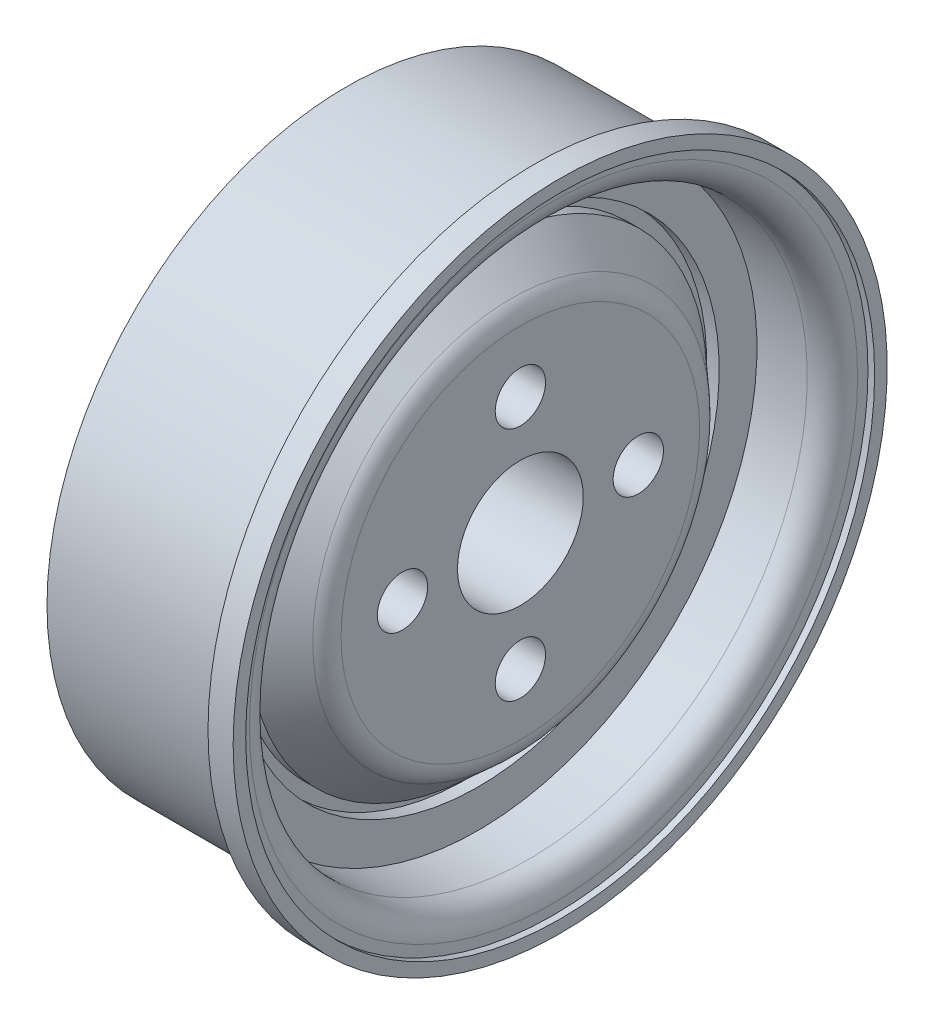
ISO-10303-21;
HEADER;
FILE_DESCRIPTION(('STEP AP214'),'2;1');
FILE_NAME('part.step','',(''),(''),'','','');
FILE_SCHEMA(('AUTOMOTIVE_DESIGN { 1 0 10303 214 1 1 1 1 }'));
ENDSEC;
DATA;
#1=APPLICATION_CONTEXT('core data for automotive mechanical design processes');
#2=APPLICATION_PROTOCOL_DEFINITION('international standard','automotive_design',2000,#1);
#3=PRODUCT_CONTEXT('',#1,'mechanical');
#4=PRODUCT('Part','Part','',(#3));
#5=PRODUCT_RELATED_PRODUCT_CATEGORY('part','',(#4));
#6=PRODUCT_DEFINITION_FORMATION('','',#4);
#7=PRODUCT_DEFINITION_CONTEXT('part definition',#1,'design');
#8=PRODUCT_DEFINITION('design','',#6,#7);
#9=PRODUCT_DEFINITION_SHAPE('','',#8);
#10=(LENGTH_UNIT() NAMED_UNIT(*) SI_UNIT(.MILLI.,.METRE.));
#11=(NAMED_UNIT(*) PLANE_ANGLE_UNIT() SI_UNIT($,.RADIAN.));
#12=(NAMED_UNIT(*) SI_UNIT($,.STERADIAN.) SOLID_ANGLE_UNIT());
#13=UNCERTAINTY_MEASURE_WITH_UNIT(LENGTH_MEASURE(1.E-05),#10,'distance_accuracy_value','');
#14=(GEOMETRIC_REPRESENTATION_CONTEXT(3) GLOBAL_UNCERTAINTY_ASSIGNED_CONTEXT((#13)) GLOBAL_UNIT_ASSIGNED_CONTEXT((#10,
#11,#12)) REPRESENTATION_CONTEXT('',''));
#15=CARTESIAN_POINT('',(0.,0.,0.));
#16=DIRECTION('',(0.,0.,1.));
#17=DIRECTION('',(1.,0.,0.));
#18=AXIS2_PLACEMENT_3D('',#15,#16,#17);
#19=CARTESIAN_POINT('',(-7.13969680177065,0.,0.));
#20=DIRECTION('',(-1.,0.,0.));
#21=DIRECTION('',(0.,0.,1.));
#22=AXIS2_PLACEMENT_3D('',#19,#20,#21);
#23=CYLINDRICAL_SURFACE('',#22,1.25);
#24=CARTESIAN_POINT('',(-4.83542244056852,0.,0.));
#25=DIRECTION('',(-1.,0.,0.));
#26=DIRECTION('',(0.,0.,1.));
#27=AXIS2_PLACEMENT_3D('',#24,#25,#26);
#28=CIRCLE('',#27,1.25);
#29=CARTESIAN_POINT('',(-4.83542244056852,0.,1.25));
#30=VERTEX_POINT('',#29);
#31=EDGE_CURVE('E125',#30,#30,#28,.T.);
#32=ORIENTED_EDGE('',*,*,#31,.T.);
#33=EDGE_LOOP('',(#32));
#34=FACE_BOUND('',#33,.T.);
#35=CARTESIAN_POINT('',(-1.15291247496068,0.,0.));
#36=DIRECTION('',(1.,0.,0.));
#37=DIRECTION('',(0.,0.,-1.));
#38=AXIS2_PLACEMENT_3D('',#35,#36,#37);
#39=CIRCLE('',#38,1.25);
#40=CARTESIAN_POINT('',(-1.15291247496068,0.,-1.25));
#41=VERTEX_POINT('',#40);
#42=EDGE_CURVE('E78',#41,#41,#39,.F.);
#43=ORIENTED_EDGE('',*,*,#42,.F.);
#44=EDGE_LOOP('',(#43));
#45=FACE_BOUND('',#44,.T.);
#46=ADVANCED_FACE('F39',(#34,#45),#23,.F.);
#47=CARTESIAN_POINT('',(5.42939435944994,0.,-12.5));
#48=DIRECTION('',(-1.,0.,0.));
#49=DIRECTION('',(0.,0.,1.));
#50=AXIS2_PLACEMENT_3D('',#47,#48,#49);
#51=PLANE('',#50);
#52=CARTESIAN_POINT('',(5.42939435944994,0.,0.));
#53=DIRECTION('',(-1.,0.,0.));
#54=DIRECTION('',(0.,0.,1.));
#55=AXIS2_PLACEMENT_3D('',#52,#53,#54);
#56=CIRCLE('',#55,13.);
#57=CARTESIAN_POINT('',(5.42939435944994,0.,13.));
#58=VERTEX_POINT('',#57);
#59=EDGE_CURVE('E86',#58,#58,#56,.T.);
#60=ORIENTED_EDGE('',*,*,#59,.F.);
#61=EDGE_LOOP('',(#60));
#62=FACE_BOUND('',#61,.T.);
#63=CARTESIAN_POINT('',(5.42939435944994,0.,0.));
#64=DIRECTION('',(-1.,0.,0.));
#65=DIRECTION('',(0.,0.,1.));
#66=AXIS2_PLACEMENT_3D('',#63,#64,#65);
#67=CIRCLE('',#66,12.5);
#68=CARTESIAN_POINT('',(5.42939435944994,0.,12.5));
#69=VERTEX_POINT('',#68);
#70=EDGE_CURVE('E54',#69,#69,#67,.T.);
#71=ORIENTED_EDGE('',*,*,#70,.T.);
#72=EDGE_LOOP('',(#71));
#73=FACE_BOUND('',#72,.T.);
#74=ADVANCED_FACE('F164',(#62,#73),#51,.F.);
#75=CARTESIAN_POINT('',(-7.13969680177065,0.,0.));
#76=DIRECTION('',(-1.,0.,0.));
#77=DIRECTION('',(0.,0.,1.));
#78=AXIS2_PLACEMENT_3D('',#75,#76,#77);
#79=CYLINDRICAL_SURFACE('',#78,12.5);
#80=ORIENTED_EDGE('',*,*,#70,.F.);
#81=EDGE_LOOP('',(#80));
#82=FACE_BOUND('',#81,.T.);
#83=CARTESIAN_POINT('',(5.16457755943148,0.,0.));
#84=DIRECTION('',(-1.,0.,0.));
#85=DIRECTION('',(0.,0.,1.));
#86=AXIS2_PLACEMENT_3D('',#83,#84,#85);
#87=CIRCLE('',#86,12.5);
#88=CARTESIAN_POINT('',(5.16457755943148,0.,12.5));
#89=VERTEX_POINT('',#88);
#90=EDGE_CURVE('E157',#89,#89,#87,.T.);
#91=ORIENTED_EDGE('',*,*,#90,.T.);
#92=EDGE_LOOP('',(#91));
#93=FACE_BOUND('',#92,.T.);
#94=ADVANCED_FACE('F166',(#82,#93),#79,.F.);
#95=CARTESIAN_POINT('',(5.16457755943148,0.,-12.5));
#96=DIRECTION('',(-1.,0.,0.));
#97=DIRECTION('',(0.,0.,1.));
#98=AXIS2_PLACEMENT_3D('',#95,#96,#97);
#99=PLANE('',#98);
#100=CARTESIAN_POINT('',(5.16457755943148,0.,0.));
#101=DIRECTION('',(-1.,0.,0.));
#102=DIRECTION('',(0.,0.,1.));
#103=AXIS2_PLACEMENT_3D('',#100,#101,#102);
#104=CIRCLE('',#103,12.0868416737905);
#105=CARTESIAN_POINT('',(5.16457755943148,0.,12.0868416737905));
#106=VERTEX_POINT('',#105);
#107=EDGE_CURVE('E48',#106,#106,#104,.T.);
#108=ORIENTED_EDGE('',*,*,#107,.T.);
#109=EDGE_LOOP('',(#108));
#110=FACE_BOUND('',#109,.T.);
#111=ORIENTED_EDGE('',*,*,#90,.F.);
#112=EDGE_LOOP('',(#111));
#113=FACE_BOUND('',#112,.T.);
#114=ADVANCED_FACE('F169',(#110,#113),#99,.F.);
#115=CARTESIAN_POINT('',(-7.13969680177065,0.,0.));
#116=DIRECTION('',(-1.,0.,0.));
#117=DIRECTION('',(0.,0.,1.));
#118=AXIS2_PLACEMENT_3D('',#115,#116,#117);
#119=CYLINDRICAL_SURFACE('',#118,11.0868416737905);
#120=CARTESIAN_POINT('',(4.16457755943148,0.,0.));
#121=DIRECTION('',(-1.,0.,0.));
#122=DIRECTION('',(0.,0.,1.));
#123=AXIS2_PLACEMENT_3D('',#120,#121,#122);
#124=CIRCLE('',#123,11.0868416737905);
#125=CARTESIAN_POINT('',(4.16457755943148,0.,11.0868416737905));
#126=VERTEX_POINT('',#125);
#127=EDGE_CURVE('E10',#126,#126,#124,.F.);
#128=ORIENTED_EDGE('',*,*,#127,.T.);
#129=EDGE_LOOP('',(#128));
#130=FACE_BOUND('',#129,.T.);
#131=CARTESIAN_POINT('',(2.16457755943148,0.,0.));
#132=DIRECTION('',(-1.,0.,0.));
#133=DIRECTION('',(0.,0.,1.));
#134=AXIS2_PLACEMENT_3D('',#131,#132,#133);
#135=CIRCLE('',#134,11.0868416737905);
#136=CARTESIAN_POINT('',(2.16457755943148,0.,11.0868416737905));
#137=VERTEX_POINT('',#136);
#138=EDGE_CURVE('E153',#137,#137,#135,.T.);
#139=ORIENTED_EDGE('',*,*,#138,.T.);
#140=EDGE_LOOP('',(#139));
#141=FACE_BOUND('',#140,.T.);
#142=ADVANCED_FACE('F174',(#130,#141),#119,.F.);
#143=CARTESIAN_POINT('',(2.16457755943148,0.,-11.0868416737905));
#144=DIRECTION('',(-1.,0.,0.));
#145=DIRECTION('',(0.,0.,1.));
#146=AXIS2_PLACEMENT_3D('',#143,#144,#145);
#147=PLANE('',#146);
#148=ORIENTED_EDGE('',*,*,#138,.F.);
#149=EDGE_LOOP('',(#148));
#150=FACE_BOUND('',#149,.T.);
#151=CARTESIAN_POINT('',(2.16457755943148,0.,0.));
#152=DIRECTION('',(-1.,0.,0.));
#153=DIRECTION('',(0.,0.,1.));
#154=AXIS2_PLACEMENT_3D('',#151,#152,#153);
#155=CIRCLE('',#154,9.58684167379053);
#156=CARTESIAN_POINT('',(2.16457755943148,0.,9.58684167379053));
#157=VERTEX_POINT('',#156);
#158=EDGE_CURVE('E149',#157,#157,#155,.T.);
#159=ORIENTED_EDGE('',*,*,#158,.T.);
#160=EDGE_LOOP('',(#159));
#161=FACE_BOUND('',#160,.T.);
#162=ADVANCED_FACE('F180',(#150,#161),#147,.F.);
#163=CARTESIAN_POINT('',(-7.13969680177065,0.,0.));
#164=DIRECTION('',(-1.,0.,0.));
#165=DIRECTION('',(0.,0.,1.));
#166=AXIS2_PLACEMENT_3D('',#163,#164,#165);
#167=CYLINDRICAL_SURFACE('',#166,9.58684167379053);
#168=ORIENTED_EDGE('',*,*,#158,.F.);
#169=EDGE_LOOP('',(#168));
#170=FACE_BOUND('',#169,.T.);
#171=CARTESIAN_POINT('',(1.66457755943148,0.,0.));
#172=DIRECTION('',(-1.,0.,0.));
#173=DIRECTION('',(0.,0.,1.));
#174=AXIS2_PLACEMENT_3D('',#171,#172,#173);
#175=CIRCLE('',#174,9.58684167379053);
#176=CARTESIAN_POINT('',(1.66457755943148,0.,9.58684167379053));
#177=VERTEX_POINT('',#176);
#178=EDGE_CURVE('E145',#177,#177,#175,.T.);
#179=ORIENTED_EDGE('',*,*,#178,.T.);
#180=EDGE_LOOP('',(#179));
#181=FACE_BOUND('',#180,.T.);
#182=ADVANCED_FACE('F212',(#170,#181),#167,.F.);
#183=CARTESIAN_POINT('',(1.66457755943148,0.,-9.58684167379053));
#184=DIRECTION('',(-1.,0.,0.));
#185=DIRECTION('',(0.,0.,1.));
#186=AXIS2_PLACEMENT_3D('',#183,#184,#185);
#187=PLANE('',#186);
#188=ORIENTED_EDGE('',*,*,#178,.F.);
#189=EDGE_LOOP('',(#188));
#190=FACE_BOUND('',#189,.T.);
#191=CARTESIAN_POINT('',(1.66457755943148,0.,0.));
#192=DIRECTION('',(-1.,0.,0.));
#193=DIRECTION('',(0.,0.,1.));
#194=AXIS2_PLACEMENT_3D('',#191,#192,#193);
#195=CIRCLE('',#194,9.08684167379053);
#196=CARTESIAN_POINT('',(1.66457755943148,0.,9.08684167379053));
#197=VERTEX_POINT('',#196);
#198=EDGE_CURVE('E141',#197,#197,#195,.T.);
#199=ORIENTED_EDGE('',*,*,#198,.T.);
#200=EDGE_LOOP('',(#199));
#201=FACE_BOUND('',#200,.T.);
#202=ADVANCED_FACE('F208',(#190,#201),#187,.F.);
#203=CARTESIAN_POINT('',(-7.13969680177065,0.,0.));
#204=DIRECTION('',(-1.,0.,0.));
#205=DIRECTION('',(0.,0.,1.));
#206=AXIS2_PLACEMENT_3D('',#203,#204,#205);
#207=CYLINDRICAL_SURFACE('',#206,9.08684167379053);
#208=ORIENTED_EDGE('',*,*,#198,.F.);
#209=EDGE_LOOP('',(#208));
#210=FACE_BOUND('',#209,.T.);
#211=CARTESIAN_POINT('',(2.16457755943148,0.,0.));
#212=DIRECTION('',(-1.,0.,0.));
#213=DIRECTION('',(0.,0.,1.));
#214=AXIS2_PLACEMENT_3D('',#211,#212,#213);
#215=CIRCLE('',#214,9.08684167379053);
#216=CARTESIAN_POINT('',(2.16457755943148,0.,9.08684167379053));
#217=VERTEX_POINT('',#216);
#218=EDGE_CURVE('E137',#217,#217,#215,.T.);
#219=ORIENTED_EDGE('',*,*,#218,.T.);
#220=EDGE_LOOP('',(#219));
#221=FACE_BOUND('',#220,.T.);
#222=ADVANCED_FACE('F204',(#210,#221),#207,.T.);
#223=CARTESIAN_POINT('',(3.48987513472586,0.,0.));
#224=DIRECTION('',(-1.,0.,0.));
#225=DIRECTION('',(0.,0.,1.));
#226=AXIS2_PLACEMENT_3D('',#223,#224,#225);
#227=CONICAL_SURFACE('',#226,7.89433478274952,0.73270631676556);
#228=ORIENTED_EDGE('',*,*,#218,.F.);
#229=EDGE_LOOP('',(#228));
#230=FACE_BOUND('',#229,.T.);
#231=CARTESIAN_POINT('',(3.48987513472586,0.,0.));
#232=DIRECTION('',(-1.,0.,0.));
#233=DIRECTION('',(0.,0.,1.));
#234=AXIS2_PLACEMENT_3D('',#231,#232,#233);
#235=CIRCLE('',#234,7.89433478274952);
#236=CARTESIAN_POINT('',(3.48987513472586,0.,7.89433478274952));
#237=VERTEX_POINT('',#236);
#238=EDGE_CURVE('E133',#237,#237,#235,.T.);
#239=ORIENTED_EDGE('',*,*,#238,.T.);
#240=EDGE_LOOP('',(#239));
#241=FACE_BOUND('',#240,.T.);
#242=ADVANCED_FACE('F200',(#230,#241),#227,.T.);
#243=CARTESIAN_POINT('',(2.84708752503932,0.,0.));
#244=DIRECTION('',(-1.,0.,0.));
#245=DIRECTION('',(0.,0.,1.));
#246=AXIS2_PLACEMENT_3D('',#243,#244,#245);
#247=TOROIDAL_SURFACE('',#246,7.12829033963054,1.);
#248=ORIENTED_EDGE('',*,*,#238,.F.);
#249=EDGE_LOOP('',(#248));
#250=FACE_BOUND('',#249,.T.);
#251=CARTESIAN_POINT('',(3.84708752503932,0.,0.));
#252=DIRECTION('',(-1.,0.,0.));
#253=DIRECTION('',(0.,0.,1.));
#254=AXIS2_PLACEMENT_3D('',#251,#252,#253);
#255=CIRCLE('',#254,7.12829033963054);
#256=CARTESIAN_POINT('',(3.84708752503932,0.,7.12829033963054));
#257=VERTEX_POINT('',#256);
#258=EDGE_CURVE('E129',#257,#257,#255,.T.);
#259=ORIENTED_EDGE('',*,*,#258,.T.);
#260=EDGE_LOOP('',(#259));
#261=FACE_BOUND('',#260,.T.);
#262=ADVANCED_FACE('F197',(#250,#261),#247,.T.);
#263=CARTESIAN_POINT('',(3.84708752503932,0.,-7.12829033963054));
#264=DIRECTION('',(-1.,0.,0.));
#265=DIRECTION('',(0.,0.,1.));
#266=AXIS2_PLACEMENT_3D('',#263,#264,#265);
#267=PLANE('',#266);
#268=CARTESIAN_POINT('',(3.84708752503932,4.68715005992047,0.));
#269=DIRECTION('',(-1.,0.,0.));
#270=DIRECTION('',(0.,0.,1.));
#271=AXIS2_PLACEMENT_3D('',#268,#269,#270);
#272=CIRCLE('',#271,1.);
#273=CARTESIAN_POINT('',(3.84708752503932,4.68715005992047,1.));
#274=VERTEX_POINT('',#273);
#275=EDGE_CURVE('E77',#274,#274,#272,.T.);
#276=ORIENTED_EDGE('',*,*,#275,.T.);
#277=EDGE_LOOP('',(#276));
#278=FACE_BOUND('',#277,.T.);
#279=CARTESIAN_POINT('',(3.84708752503932,1.32355801562059E-13,-4.6871500599206));
#280=DIRECTION('',(-1.,0.,0.));
#281=DIRECTION('',(0.,0.,1.));
#282=AXIS2_PLACEMENT_3D('',#279,#280,#281);
#283=CIRCLE('',#282,1.);
#284=CARTESIAN_POINT('',(3.84708752503932,1.32355801562059E-13,-3.6871500599206));
#285=VERTEX_POINT('',#284);
#286=EDGE_CURVE('E73',#285,#285,#283,.T.);
#287=ORIENTED_EDGE('',*,*,#286,.T.);
#288=EDGE_LOOP('',(#287));
#289=FACE_BOUND('',#288,.T.);
#290=CARTESIAN_POINT('',(3.84708752503932,-4.68715005992047,-2.64711603124119E-13));
#291=DIRECTION('',(-1.,0.,0.));
#292=DIRECTION('',(0.,0.,1.));
#293=AXIS2_PLACEMENT_3D('',#290,#291,#292);
#294=CIRCLE('',#293,1.);
#295=CARTESIAN_POINT('',(3.84708752503932,-4.68715005992047,0.999999999999735));
#296=VERTEX_POINT('',#295);
#297=EDGE_CURVE('E68',#296,#296,#294,.T.);
#298=ORIENTED_EDGE('',*,*,#297,.T.);
#299=EDGE_LOOP('',(#298));
#300=FACE_BOUND('',#299,.T.);
#301=CARTESIAN_POINT('',(3.84708752503932,-1.3292981189386E-13,4.68715005992033));
#302=DIRECTION('',(-1.,0.,0.));
#303=DIRECTION('',(0.,0.,1.));
#304=AXIS2_PLACEMENT_3D('',#301,#302,#303);
#305=CIRCLE('',#304,1.);
#306=CARTESIAN_POINT('',(3.84708752503932,-1.3292981189386E-13,5.68715005992033));
#307=VERTEX_POINT('',#306);
#308=EDGE_CURVE('E62',#307,#307,#305,.T.);
#309=ORIENTED_EDGE('',*,*,#308,.T.);
#310=EDGE_LOOP('',(#309));
#311=FACE_BOUND('',#310,.T.);
#312=CARTESIAN_POINT('',(3.84708752503932,0.,0.));
#313=DIRECTION('',(-1.,0.,0.));
#314=DIRECTION('',(0.,0.,1.));
#315=AXIS2_PLACEMENT_3D('',#312,#313,#314);
#316=CIRCLE('',#315,2.5);
#317=CARTESIAN_POINT('',(3.84708752503932,0.,2.5));
#318=VERTEX_POINT('',#317);
#319=EDGE_CURVE('E43',#318,#318,#316,.T.);
#320=ORIENTED_EDGE('',*,*,#319,.T.);
#321=EDGE_LOOP('',(#320));
#322=FACE_BOUND('',#321,.T.);
#323=ORIENTED_EDGE('',*,*,#258,.F.);
#324=EDGE_LOOP('',(#323));
#325=FACE_BOUND('',#324,.T.);
#326=ADVANCED_FACE('F194',(#278,#289,#300,#311,#322,#325),#267,.F.);
#327=CARTESIAN_POINT('',(-4.83542244056852,0.,-3.25));
#328=DIRECTION('',(1.,0.,0.));
#329=DIRECTION('',(0.,0.,-1.));
#330=AXIS2_PLACEMENT_3D('',#327,#328,#329);
#331=PLANE('',#330);
#332=ORIENTED_EDGE('',*,*,#31,.F.);
#333=EDGE_LOOP('',(#332));
#334=FACE_BOUND('',#333,.T.);
#335=CARTESIAN_POINT('',(-4.83542244056852,0.,0.));
#336=DIRECTION('',(-1.,0.,0.));
#337=DIRECTION('',(0.,0.,1.));
#338=AXIS2_PLACEMENT_3D('',#335,#336,#337);
#339=CIRCLE('',#338,3.25);
#340=CARTESIAN_POINT('',(-4.83542244056852,0.,3.25));
#341=VERTEX_POINT('',#340);
#342=EDGE_CURVE('E121',#341,#341,#339,.T.);
#343=ORIENTED_EDGE('',*,*,#342,.T.);
#344=EDGE_LOOP('',(#343));
#345=FACE_BOUND('',#344,.T.);
#346=ADVANCED_FACE('F192',(#334,#345),#331,.F.);
#347=CARTESIAN_POINT('',(-7.13969680177065,0.,0.));
#348=DIRECTION('',(-1.,0.,0.));
#349=DIRECTION('',(0.,0.,1.));
#350=AXIS2_PLACEMENT_3D('',#347,#348,#349);
#351=CYLINDRICAL_SURFACE('',#350,3.25);
#352=ORIENTED_EDGE('',*,*,#342,.F.);
#353=EDGE_LOOP('',(#352));
#354=FACE_BOUND('',#353,.T.);
#355=CARTESIAN_POINT('',(0.164577559431481,0.,0.));
#356=DIRECTION('',(-1.,0.,0.));
#357=DIRECTION('',(0.,0.,1.));
#358=AXIS2_PLACEMENT_3D('',#355,#356,#357);
#359=CIRCLE('',#358,3.25);
#360=CARTESIAN_POINT('',(0.164577559431481,0.,3.25));
#361=VERTEX_POINT('',#360);
#362=EDGE_CURVE('E117',#361,#361,#359,.T.);
#363=ORIENTED_EDGE('',*,*,#362,.T.);
#364=EDGE_LOOP('',(#363));
#365=FACE_BOUND('',#364,.T.);
#366=ADVANCED_FACE('F270',(#354,#365),#351,.T.);
#367=CARTESIAN_POINT('',(0.164577559431481,0.,-9.9));
#368=DIRECTION('',(1.,0.,0.));
#369=DIRECTION('',(0.,0.,-1.));
#370=AXIS2_PLACEMENT_3D('',#367,#368,#369);
#371=PLANE('',#370);
#372=CARTESIAN_POINT('',(0.16457755943148,4.68715005992047,0.));
#373=DIRECTION('',(1.,0.,0.));
#374=DIRECTION('',(0.,0.,-1.));
#375=AXIS2_PLACEMENT_3D('',#372,#373,#374);
#376=CIRCLE('',#375,1.);
#377=CARTESIAN_POINT('',(0.16457755943148,4.68715005992047,-1.));
#378=VERTEX_POINT('',#377);
#379=EDGE_CURVE('E74',#378,#378,#376,.T.);
#380=ORIENTED_EDGE('',*,*,#379,.T.);
#381=EDGE_LOOP('',(#380));
#382=FACE_BOUND('',#381,.T.);
#383=CARTESIAN_POINT('',(0.16457755943148,1.32355801562059E-13,-4.6871500599206));
#384=DIRECTION('',(1.,0.,0.));
#385=DIRECTION('',(0.,0.,-1.));
#386=AXIS2_PLACEMENT_3D('',#383,#384,#385);
#387=CIRCLE('',#386,1.);
#388=CARTESIAN_POINT('',(0.16457755943148,1.32355801562059E-13,-5.6871500599206));
#389=VERTEX_POINT('',#388);
#390=EDGE_CURVE('E69',#389,#389,#387,.T.);
#391=ORIENTED_EDGE('',*,*,#390,.T.);
#392=EDGE_LOOP('',(#391));
#393=FACE_BOUND('',#392,.T.);
#394=CARTESIAN_POINT('',(0.16457755943148,-4.68715005992047,-2.64711603124119E-13));
#395=DIRECTION('',(1.,0.,0.));
#396=DIRECTION('',(0.,0.,-1.));
#397=AXIS2_PLACEMENT_3D('',#394,#395,#396);
#398=CIRCLE('',#397,1.);
#399=CARTESIAN_POINT('',(0.16457755943148,-4.68715005992047,-1.00000000000026));
#400=VERTEX_POINT('',#399);
#401=EDGE_CURVE('E64',#400,#400,#398,.T.);
#402=ORIENTED_EDGE('',*,*,#401,.T.);
#403=EDGE_LOOP('',(#402));
#404=FACE_BOUND('',#403,.T.);
#405=CARTESIAN_POINT('',(0.16457755943148,-1.3292981189386E-13,4.68715005992033));
#406=DIRECTION('',(1.,0.,0.));
#407=DIRECTION('',(0.,0.,-1.));
#408=AXIS2_PLACEMENT_3D('',#405,#406,#407);
#409=CIRCLE('',#408,1.);
#410=CARTESIAN_POINT('',(0.16457755943148,-1.3292981189386E-13,3.68715005992033));
#411=VERTEX_POINT('',#410);
#412=EDGE_CURVE('E58',#411,#411,#409,.T.);
#413=ORIENTED_EDGE('',*,*,#412,.T.);
#414=EDGE_LOOP('',(#413));
#415=FACE_BOUND('',#414,.T.);
#416=ORIENTED_EDGE('',*,*,#362,.F.);
#417=EDGE_LOOP('',(#416));
#418=FACE_BOUND('',#417,.T.);
#419=CARTESIAN_POINT('',(0.16457755943148,0.,0.));
#420=DIRECTION('',(-1.,0.,0.));
#421=DIRECTION('',(0.,0.,1.));
#422=AXIS2_PLACEMENT_3D('',#419,#420,#421);
#423=CIRCLE('',#422,9.9);
#424=CARTESIAN_POINT('',(0.16457755943148,0.,9.9));
#425=VERTEX_POINT('',#424);
#426=EDGE_CURVE('E113',#425,#425,#423,.T.);
#427=ORIENTED_EDGE('',*,*,#426,.T.);
#428=EDGE_LOOP('',(#427));
#429=FACE_BOUND('',#428,.T.);
#430=ADVANCED_FACE('F277',(#382,#393,#404,#415,#418,#429),#371,.F.);
#431=CARTESIAN_POINT('',(-7.13969680177065,0.,0.));
#432=DIRECTION('',(-1.,0.,0.));
#433=DIRECTION('',(0.,0.,1.));
#434=AXIS2_PLACEMENT_3D('',#431,#432,#433);
#435=CYLINDRICAL_SURFACE('',#434,9.9);
#436=ORIENTED_EDGE('',*,*,#426,.F.);
#437=EDGE_LOOP('',(#436));
#438=FACE_BOUND('',#437,.T.);
#439=CARTESIAN_POINT('',(-3.07060564055006,0.,0.));
#440=DIRECTION('',(-1.,0.,0.));
#441=DIRECTION('',(0.,0.,1.));
#442=AXIS2_PLACEMENT_3D('',#439,#440,#441);
#443=CIRCLE('',#442,9.9);
#444=CARTESIAN_POINT('',(-3.07060564055006,0.,9.9));
#445=VERTEX_POINT('',#444);
#446=EDGE_CURVE('E109',#445,#445,#443,.T.);
#447=ORIENTED_EDGE('',*,*,#446,.T.);
#448=EDGE_LOOP('',(#447));
#449=FACE_BOUND('',#448,.T.);
#450=ADVANCED_FACE('F284',(#438,#449),#435,.F.);
#451=CARTESIAN_POINT('',(-3.07060564055006,0.,-11.9));
#452=DIRECTION('',(1.,0.,0.));
#453=DIRECTION('',(0.,0.,-1.));
#454=AXIS2_PLACEMENT_3D('',#451,#452,#453);
#455=PLANE('',#454);
#456=ORIENTED_EDGE('',*,*,#446,.F.);
#457=EDGE_LOOP('',(#456));
#458=FACE_BOUND('',#457,.T.);
#459=CARTESIAN_POINT('',(-3.07060564055006,0.,0.));
#460=DIRECTION('',(-1.,0.,0.));
#461=DIRECTION('',(0.,0.,1.));
#462=AXIS2_PLACEMENT_3D('',#459,#460,#461);
#463=CIRCLE('',#462,11.9);
#464=CARTESIAN_POINT('',(-3.07060564055006,0.,11.9));
#465=VERTEX_POINT('',#464);
#466=EDGE_CURVE('E105',#465,#465,#463,.T.);
#467=ORIENTED_EDGE('',*,*,#466,.T.);
#468=EDGE_LOOP('',(#467));
#469=FACE_BOUND('',#468,.T.);
#470=ADVANCED_FACE('F292',(#458,#469),#455,.F.);
#471=CARTESIAN_POINT('',(-7.13969680177065,0.,0.));
#472=DIRECTION('',(-1.,0.,0.));
#473=DIRECTION('',(0.,0.,1.));
#474=AXIS2_PLACEMENT_3D('',#471,#472,#473);
#475=CYLINDRICAL_SURFACE('',#474,11.9);
#476=ORIENTED_EDGE('',*,*,#466,.F.);
#477=EDGE_LOOP('',(#476));
#478=FACE_BOUND('',#477,.T.);
#479=CARTESIAN_POINT('',(4.42939435944994,0.,0.));
#480=DIRECTION('',(-1.,0.,0.));
#481=DIRECTION('',(0.,0.,1.));
#482=AXIS2_PLACEMENT_3D('',#479,#480,#481);
#483=CIRCLE('',#482,11.9);
#484=CARTESIAN_POINT('',(4.42939435944994,0.,11.9));
#485=VERTEX_POINT('',#484);
#486=EDGE_CURVE('E101',#485,#485,#483,.T.);
#487=ORIENTED_EDGE('',*,*,#486,.T.);
#488=EDGE_LOOP('',(#487));
#489=FACE_BOUND('',#488,.T.);
#490=ADVANCED_FACE('F300',(#478,#489),#475,.T.);
#491=CARTESIAN_POINT('',(4.42939435944994,0.,-13.));
#492=DIRECTION('',(1.,0.,0.));
#493=DIRECTION('',(0.,0.,-1.));
#494=AXIS2_PLACEMENT_3D('',#491,#492,#493);
#495=PLANE('',#494);
#496=ORIENTED_EDGE('',*,*,#486,.F.);
#497=EDGE_LOOP('',(#496));
#498=FACE_BOUND('',#497,.T.);
#499=CARTESIAN_POINT('',(4.42939435944994,0.,0.));
#500=DIRECTION('',(-1.,0.,0.));
#501=DIRECTION('',(0.,0.,1.));
#502=AXIS2_PLACEMENT_3D('',#499,#500,#501);
#503=CIRCLE('',#502,13.);
#504=CARTESIAN_POINT('',(4.42939435944994,0.,13.));
#505=VERTEX_POINT('',#504);
#506=EDGE_CURVE('E97',#505,#505,#503,.T.);
#507=ORIENTED_EDGE('',*,*,#506,.T.);
#508=EDGE_LOOP('',(#507));
#509=FACE_BOUND('',#508,.T.);
#510=ADVANCED_FACE('F308',(#498,#509),#495,.F.);
#511=CARTESIAN_POINT('',(-7.13969680177065,0.,0.));
#512=DIRECTION('',(-1.,0.,0.));
#513=DIRECTION('',(0.,0.,1.));
#514=AXIS2_PLACEMENT_3D('',#511,#512,#513);
#515=CYLINDRICAL_SURFACE('',#514,13.);
#516=ORIENTED_EDGE('',*,*,#506,.F.);
#517=EDGE_LOOP('',(#516));
#518=FACE_BOUND('',#517,.T.);
#519=ORIENTED_EDGE('',*,*,#59,.T.);
#520=EDGE_LOOP('',(#519));
#521=FACE_BOUND('',#520,.T.);
#522=ADVANCED_FACE('F316',(#518,#521),#515,.T.);
#523=CARTESIAN_POINT('',(4.16457755943148,0.,0.));
#524=DIRECTION('',(-1.,0.,0.));
#525=DIRECTION('',(0.,0.,1.));
#526=AXIS2_PLACEMENT_3D('',#523,#524,#525);
#527=TOROIDAL_SURFACE('',#526,12.0868416737905,1.);
#528=ORIENTED_EDGE('',*,*,#127,.F.);
#529=EDGE_LOOP('',(#528));
#530=FACE_BOUND('',#529,.T.);
#531=ORIENTED_EDGE('',*,*,#107,.F.);
#532=EDGE_LOOP('',(#531));
#533=FACE_BOUND('',#532,.T.);
#534=ADVANCED_FACE('F41',(#530,#533),#527,.T.);
#535=CARTESIAN_POINT('',(-1.15291247496068,-1.3292981189386E-13,4.68715005992033));
#536=DIRECTION('',(1.,0.,0.));
#537=DIRECTION('',(0.,0.,-1.));
#538=AXIS2_PLACEMENT_3D('',#535,#536,#537);
#539=CYLINDRICAL_SURFACE('',#538,1.);
#540=ORIENTED_EDGE('',*,*,#412,.F.);
#541=EDGE_LOOP('',(#540));
#542=FACE_BOUND('',#541,.T.);
#543=ORIENTED_EDGE('',*,*,#308,.F.);
#544=EDGE_LOOP('',(#543));
#545=FACE_BOUND('',#544,.T.);
#546=ADVANCED_FACE('F331',(#542,#545),#539,.F.);
#547=CARTESIAN_POINT('',(-1.15291247496068,-4.68715005992047,-2.64711603124119E-13));
#548=DIRECTION('',(1.,0.,0.));
#549=DIRECTION('',(0.,0.,-1.));
#550=AXIS2_PLACEMENT_3D('',#547,#548,#549);
#551=CYLINDRICAL_SURFACE('',#550,1.);
#552=ORIENTED_EDGE('',*,*,#401,.F.);
#553=EDGE_LOOP('',(#552));
#554=FACE_BOUND('',#553,.T.);
#555=ORIENTED_EDGE('',*,*,#297,.F.);
#556=EDGE_LOOP('',(#555));
#557=FACE_BOUND('',#556,.T.);
#558=ADVANCED_FACE('F337',(#554,#557),#551,.F.);
#559=CARTESIAN_POINT('',(-1.15291247496068,1.32355801562059E-13,-4.6871500599206));
#560=DIRECTION('',(1.,0.,0.));
#561=DIRECTION('',(0.,0.,-1.));
#562=AXIS2_PLACEMENT_3D('',#559,#560,#561);
#563=CYLINDRICAL_SURFACE('',#562,1.);
#564=ORIENTED_EDGE('',*,*,#390,.F.);
#565=EDGE_LOOP('',(#564));
#566=FACE_BOUND('',#565,.T.);
#567=ORIENTED_EDGE('',*,*,#286,.F.);
#568=EDGE_LOOP('',(#567));
#569=FACE_BOUND('',#568,.T.);
#570=ADVANCED_FACE('F345',(#566,#569),#563,.F.);
#571=CARTESIAN_POINT('',(-1.15291247496068,4.68715005992047,0.));
#572=DIRECTION('',(1.,0.,0.));
#573=DIRECTION('',(0.,0.,-1.));
#574=AXIS2_PLACEMENT_3D('',#571,#572,#573);
#575=CYLINDRICAL_SURFACE('',#574,1.);
#576=ORIENTED_EDGE('',*,*,#379,.F.);
#577=EDGE_LOOP('',(#576));
#578=FACE_BOUND('',#577,.T.);
#579=ORIENTED_EDGE('',*,*,#275,.F.);
#580=EDGE_LOOP('',(#579));
#581=FACE_BOUND('',#580,.T.);
#582=ADVANCED_FACE('F353',(#578,#581),#575,.F.);
#583=CARTESIAN_POINT('',(-1.15291247496068,0.,0.));
#584=DIRECTION('',(1.,0.,0.));
#585=DIRECTION('',(0.,0.,-1.));
#586=AXIS2_PLACEMENT_3D('',#583,#584,#585);
#587=CYLINDRICAL_SURFACE('',#586,2.5);
#588=CARTESIAN_POINT('',(-1.15291247496068,0.,0.));
#589=DIRECTION('',(1.,0.,0.));
#590=DIRECTION('',(0.,0.,-1.));
#591=AXIS2_PLACEMENT_3D('',#588,#589,#590);
#592=CIRCLE('',#591,2.5);
#593=CARTESIAN_POINT('',(-1.15291247496068,0.,-2.5));
#594=VERTEX_POINT('',#593);
#595=EDGE_CURVE('E63',#594,#594,#592,.T.);
#596=ORIENTED_EDGE('',*,*,#595,.F.);
#597=EDGE_LOOP('',(#596));
#598=FACE_BOUND('',#597,.T.);
#599=ORIENTED_EDGE('',*,*,#319,.F.);
#600=EDGE_LOOP('',(#599));
#601=FACE_BOUND('',#600,.T.);
#602=ADVANCED_FACE('F361',(#598,#601),#587,.F.);
#603=CARTESIAN_POINT('',(-1.15291247496068,0.,0.));
#604=DIRECTION('',(1.,0.,0.));
#605=DIRECTION('',(0.,0.,-1.));
#606=AXIS2_PLACEMENT_3D('',#603,#604,#605);
#607=PLANE('',#606);
#608=ORIENTED_EDGE('',*,*,#595,.T.);
#609=EDGE_LOOP('',(#608));
#610=FACE_BOUND('',#609,.T.);
#611=ORIENTED_EDGE('',*,*,#42,.T.);
#612=EDGE_LOOP('',(#611));
#613=FACE_BOUND('',#612,.T.);
#614=ADVANCED_FACE('F369',(#610,#613),#607,.T.);
#615=CLOSED_SHELL('',(#46,#74,#94,#114,#142,#162,#182,#202,#222,#242,#262,#326,#346,#366,#430,
#450,#470,#490,#510,#522,#534,#546,#558,#570,#582,#602,#614));
#616=MANIFOLD_SOLID_BREP('B2',#615);
#617=ADVANCED_BREP_SHAPE_REPRESENTATION('',(#18,#616),#14);
#618=SHAPE_DEFINITION_REPRESENTATION(#9,#617);
ENDSEC;
END-ISO-10303-21;
